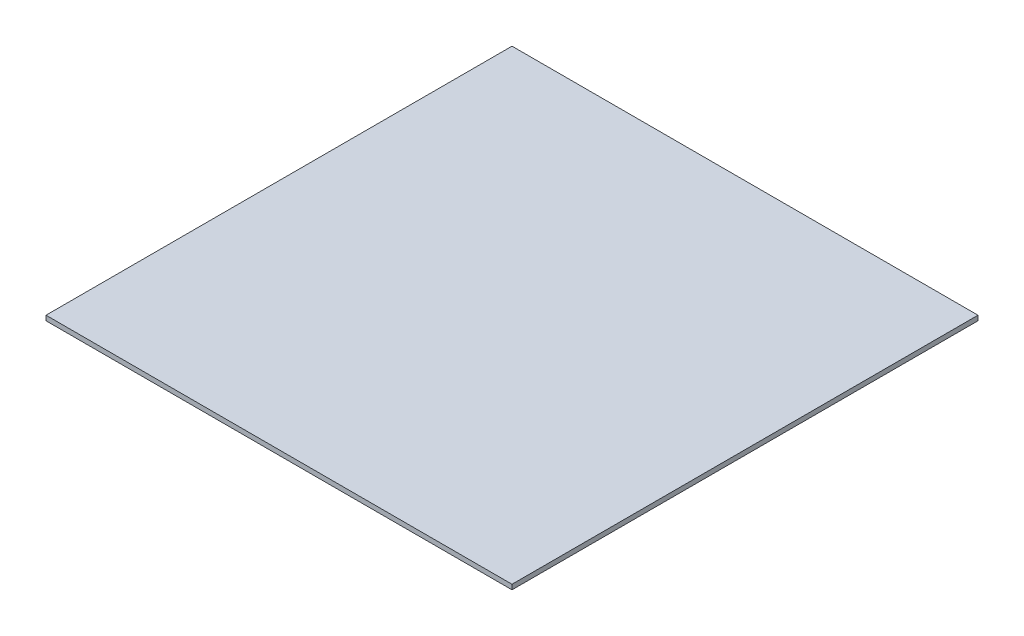
ISO-10303-21;
HEADER;
FILE_DESCRIPTION(('STEP AP214'),'2;1');
FILE_NAME('part.step','',(''),(''),'','','');
FILE_SCHEMA(('AUTOMOTIVE_DESIGN { 1 0 10303 214 1 1 1 1 }'));
ENDSEC;
DATA;
#1=APPLICATION_CONTEXT('core data for automotive mechanical design processes');
#2=APPLICATION_PROTOCOL_DEFINITION('international standard','automotive_design',2000,#1);
#3=PRODUCT_CONTEXT('',#1,'mechanical');
#4=PRODUCT('Part','Part','',(#3));
#5=PRODUCT_RELATED_PRODUCT_CATEGORY('part','',(#4));
#6=PRODUCT_DEFINITION_FORMATION('','',#4);
#7=PRODUCT_DEFINITION_CONTEXT('part definition',#1,'design');
#8=PRODUCT_DEFINITION('design','',#6,#7);
#9=PRODUCT_DEFINITION_SHAPE('','',#8);
#10=(LENGTH_UNIT() NAMED_UNIT(*) SI_UNIT(.MILLI.,.METRE.));
#11=(NAMED_UNIT(*) PLANE_ANGLE_UNIT() SI_UNIT($,.RADIAN.));
#12=(NAMED_UNIT(*) SI_UNIT($,.STERADIAN.) SOLID_ANGLE_UNIT());
#13=UNCERTAINTY_MEASURE_WITH_UNIT(LENGTH_MEASURE(1.E-05),#10,'distance_accuracy_value','');
#14=(GEOMETRIC_REPRESENTATION_CONTEXT(3) GLOBAL_UNCERTAINTY_ASSIGNED_CONTEXT((#13)) GLOBAL_UNIT_ASSIGNED_CONTEXT((#10,
#11,#12)) REPRESENTATION_CONTEXT('',''));
#15=CARTESIAN_POINT('',(0.,0.,0.));
#16=DIRECTION('',(0.,0.,1.));
#17=DIRECTION('',(1.,0.,0.));
#18=AXIS2_PLACEMENT_3D('',#15,#16,#17);
#19=CARTESIAN_POINT('',(-152.4,-1.58750000000005,-152.4));
#20=DIRECTION('',(-1.,0.,0.));
#21=DIRECTION('',(0.,0.,1.));
#22=AXIS2_PLACEMENT_3D('',#19,#20,#21);
#23=PLANE('',#22);
#24=DIRECTION('',(0.,1.,0.));
#25=VECTOR('',#24,1.);
#26=CARTESIAN_POINT('',(-152.4,-1.58750000000005,152.4));
#27=LINE('',#26,#25);
#28=CARTESIAN_POINT('',(-152.4,-1.58750000000005,152.4));
#29=VERTEX_POINT('',#28);
#30=CARTESIAN_POINT('',(-152.4,1.58749999999995,152.4));
#31=VERTEX_POINT('',#30);
#32=EDGE_CURVE('E37',#29,#31,#27,.T.);
#33=ORIENTED_EDGE('',*,*,#32,.T.);
#34=DIRECTION('',(0.,0.,1.));
#35=VECTOR('',#34,1.);
#36=CARTESIAN_POINT('',(-152.4,1.58749999999995,-152.4));
#37=LINE('',#36,#35);
#38=CARTESIAN_POINT('',(-152.4,1.58749999999995,-152.4));
#39=VERTEX_POINT('',#38);
#40=EDGE_CURVE('E74',#39,#31,#37,.T.);
#41=ORIENTED_EDGE('',*,*,#40,.F.);
#42=DIRECTION('',(0.,1.,0.));
#43=VECTOR('',#42,1.);
#44=CARTESIAN_POINT('',(-152.4,-1.58750000000005,-152.4));
#45=LINE('',#44,#43);
#46=CARTESIAN_POINT('',(-152.4,-1.58750000000005,-152.4));
#47=VERTEX_POINT('',#46);
#48=EDGE_CURVE('E11',#47,#39,#45,.T.);
#49=ORIENTED_EDGE('',*,*,#48,.F.);
#50=DIRECTION('',(0.,0.,1.));
#51=VECTOR('',#50,1.);
#52=CARTESIAN_POINT('',(-152.4,-1.58750000000005,-152.4));
#53=LINE('',#52,#51);
#54=EDGE_CURVE('E75',#47,#29,#53,.T.);
#55=ORIENTED_EDGE('',*,*,#54,.T.);
#56=EDGE_LOOP('',(#33,#41,#49,#55));
#57=FACE_BOUND('',#56,.T.);
#58=ADVANCED_FACE('F34',(#57),#23,.T.);
#59=CARTESIAN_POINT('',(-152.4,-1.58750000000005,-152.4));
#60=DIRECTION('',(0.,0.,-1.));
#61=DIRECTION('',(-1.,0.,0.));
#62=AXIS2_PLACEMENT_3D('',#59,#60,#61);
#63=PLANE('',#62);
#64=ORIENTED_EDGE('',*,*,#48,.T.);
#65=DIRECTION('',(-1.,0.,0.));
#66=VECTOR('',#65,1.);
#67=CARTESIAN_POINT('',(-152.4,1.58749999999995,-152.4));
#68=LINE('',#67,#66);
#69=CARTESIAN_POINT('',(152.4,1.58749999999995,-152.4));
#70=VERTEX_POINT('',#69);
#71=EDGE_CURVE('E91',#70,#39,#68,.T.);
#72=ORIENTED_EDGE('',*,*,#71,.F.);
#73=DIRECTION('',(0.,1.,0.));
#74=VECTOR('',#73,1.);
#75=CARTESIAN_POINT('',(152.4,-1.58750000000005,-152.4));
#76=LINE('',#75,#74);
#77=CARTESIAN_POINT('',(152.4,-1.58750000000005,-152.4));
#78=VERTEX_POINT('',#77);
#79=EDGE_CURVE('E42',#78,#70,#76,.T.);
#80=ORIENTED_EDGE('',*,*,#79,.F.);
#81=DIRECTION('',(-1.,0.,0.));
#82=VECTOR('',#81,1.);
#83=CARTESIAN_POINT('',(-152.4,-1.58750000000005,-152.4));
#84=LINE('',#83,#82);
#85=EDGE_CURVE('E80',#78,#47,#84,.T.);
#86=ORIENTED_EDGE('',*,*,#85,.T.);
#87=EDGE_LOOP('',(#64,#72,#80,#86));
#88=FACE_BOUND('',#87,.T.);
#89=ADVANCED_FACE('F106',(#88),#63,.T.);
#90=CARTESIAN_POINT('',(152.4,-1.58750000000005,-152.4));
#91=DIRECTION('',(1.,0.,0.));
#92=DIRECTION('',(0.,0.,-1.));
#93=AXIS2_PLACEMENT_3D('',#90,#91,#92);
#94=PLANE('',#93);
#95=ORIENTED_EDGE('',*,*,#79,.T.);
#96=DIRECTION('',(0.,0.,-1.));
#97=VECTOR('',#96,1.);
#98=CARTESIAN_POINT('',(152.4,1.58749999999995,-152.4));
#99=LINE('',#98,#97);
#100=CARTESIAN_POINT('',(152.4,1.58749999999995,152.4));
#101=VERTEX_POINT('',#100);
#102=EDGE_CURVE('E87',#101,#70,#99,.T.);
#103=ORIENTED_EDGE('',*,*,#102,.F.);
#104=DIRECTION('',(0.,1.,0.));
#105=VECTOR('',#104,1.);
#106=CARTESIAN_POINT('',(152.4,-1.58750000000005,152.4));
#107=LINE('',#106,#105);
#108=CARTESIAN_POINT('',(152.4,-1.58750000000005,152.4));
#109=VERTEX_POINT('',#108);
#110=EDGE_CURVE('E79',#109,#101,#107,.T.);
#111=ORIENTED_EDGE('',*,*,#110,.F.);
#112=DIRECTION('',(0.,0.,-1.));
#113=VECTOR('',#112,1.);
#114=CARTESIAN_POINT('',(152.4,-1.58750000000005,-152.4));
#115=LINE('',#114,#113);
#116=EDGE_CURVE('E99',#109,#78,#115,.T.);
#117=ORIENTED_EDGE('',*,*,#116,.T.);
#118=EDGE_LOOP('',(#95,#103,#111,#117));
#119=FACE_BOUND('',#118,.T.);
#120=ADVANCED_FACE('F103',(#119),#94,.T.);
#121=CARTESIAN_POINT('',(-152.4,-1.58750000000005,152.4));
#122=DIRECTION('',(0.,0.,1.));
#123=DIRECTION('',(1.,0.,0.));
#124=AXIS2_PLACEMENT_3D('',#121,#122,#123);
#125=PLANE('',#124);
#126=ORIENTED_EDGE('',*,*,#110,.T.);
#127=DIRECTION('',(1.,0.,0.));
#128=VECTOR('',#127,1.);
#129=CARTESIAN_POINT('',(-152.4,1.58749999999995,152.4));
#130=LINE('',#129,#128);
#131=EDGE_CURVE('E82',#31,#101,#130,.T.);
#132=ORIENTED_EDGE('',*,*,#131,.F.);
#133=ORIENTED_EDGE('',*,*,#32,.F.);
#134=DIRECTION('',(1.,0.,0.));
#135=VECTOR('',#134,1.);
#136=CARTESIAN_POINT('',(-152.4,-1.58750000000005,152.4));
#137=LINE('',#136,#135);
#138=EDGE_CURVE('E97',#29,#109,#137,.T.);
#139=ORIENTED_EDGE('',*,*,#138,.T.);
#140=EDGE_LOOP('',(#126,#132,#133,#139));
#141=FACE_BOUND('',#140,.T.);
#142=ADVANCED_FACE('F83',(#141),#125,.T.);
#143=CARTESIAN_POINT('',(0.,-1.58750000000005,0.));
#144=DIRECTION('',(0.,1.,0.));
#145=DIRECTION('',(0.,0.,1.));
#146=AXIS2_PLACEMENT_3D('',#143,#144,#145);
#147=PLANE('',#146);
#148=ORIENTED_EDGE('',*,*,#54,.F.);
#149=ORIENTED_EDGE('',*,*,#85,.F.);
#150=ORIENTED_EDGE('',*,*,#116,.F.);
#151=ORIENTED_EDGE('',*,*,#138,.F.);
#152=EDGE_LOOP('',(#148,#149,#150,#151));
#153=FACE_BOUND('',#152,.T.);
#154=ADVANCED_FACE('F108',(#153),#147,.F.);
#155=CARTESIAN_POINT('',(0.,1.58749999999995,0.));
#156=DIRECTION('',(0.,1.,0.));
#157=DIRECTION('',(0.,0.,1.));
#158=AXIS2_PLACEMENT_3D('',#155,#156,#157);
#159=PLANE('',#158);
#160=ORIENTED_EDGE('',*,*,#40,.T.);
#161=ORIENTED_EDGE('',*,*,#131,.T.);
#162=ORIENTED_EDGE('',*,*,#102,.T.);
#163=ORIENTED_EDGE('',*,*,#71,.T.);
#164=EDGE_LOOP('',(#160,#161,#162,#163));
#165=FACE_BOUND('',#164,.T.);
#166=ADVANCED_FACE('F90',(#165),#159,.T.);
#167=CLOSED_SHELL('',(#58,#89,#120,#142,#154,#166));
#168=MANIFOLD_SOLID_BREP('B2',#167);
#169=ADVANCED_BREP_SHAPE_REPRESENTATION('',(#18,#168),#14);
#170=SHAPE_DEFINITION_REPRESENTATION(#9,#169);
ENDSEC;
END-ISO-10303-21;
